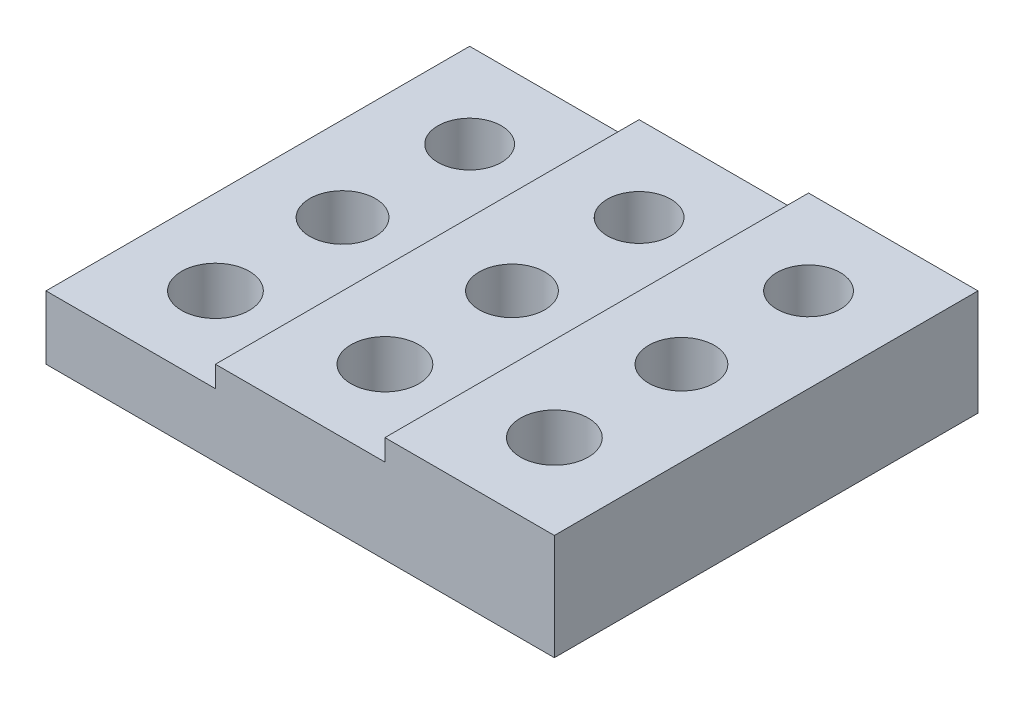
ISO-10303-21;
HEADER;
FILE_DESCRIPTION(('STEP AP214'),'2;1');
FILE_NAME('part.step','',(''),(''),'','','');
FILE_SCHEMA(('AUTOMOTIVE_DESIGN { 1 0 10303 214 1 1 1 1 }'));
ENDSEC;
DATA;
#1=APPLICATION_CONTEXT('core data for automotive mechanical design processes');
#2=APPLICATION_PROTOCOL_DEFINITION('international standard','automotive_design',2000,#1);
#3=PRODUCT_CONTEXT('',#1,'mechanical');
#4=PRODUCT('Part','Part','',(#3));
#5=PRODUCT_RELATED_PRODUCT_CATEGORY('part','',(#4));
#6=PRODUCT_DEFINITION_FORMATION('','',#4);
#7=PRODUCT_DEFINITION_CONTEXT('part definition',#1,'design');
#8=PRODUCT_DEFINITION('design','',#6,#7);
#9=PRODUCT_DEFINITION_SHAPE('','',#8);
#10=(LENGTH_UNIT() NAMED_UNIT(*) SI_UNIT(.MILLI.,.METRE.));
#11=(NAMED_UNIT(*) PLANE_ANGLE_UNIT() SI_UNIT($,.RADIAN.));
#12=(NAMED_UNIT(*) SI_UNIT($,.STERADIAN.) SOLID_ANGLE_UNIT());
#13=UNCERTAINTY_MEASURE_WITH_UNIT(LENGTH_MEASURE(1.E-05),#10,'distance_accuracy_value','');
#14=(GEOMETRIC_REPRESENTATION_CONTEXT(3) GLOBAL_UNCERTAINTY_ASSIGNED_CONTEXT((#13)) GLOBAL_UNIT_ASSIGNED_CONTEXT((#10,
#11,#12)) REPRESENTATION_CONTEXT('',''));
#15=CARTESIAN_POINT('',(0.,0.,0.));
#16=DIRECTION('',(0.,0.,1.));
#17=DIRECTION('',(1.,0.,0.));
#18=AXIS2_PLACEMENT_3D('',#15,#16,#17);
#19=CARTESIAN_POINT('',(8.,5.,0.));
#20=DIRECTION('',(-1.,0.,0.));
#21=DIRECTION('',(0.,0.,1.));
#22=AXIS2_PLACEMENT_3D('',#19,#20,#21);
#23=PLANE('',#22);
#24=DIRECTION('',(0.,0.,-1.));
#25=VECTOR('',#24,1.);
#26=CARTESIAN_POINT('',(8.,4.,0.));
#27=LINE('',#26,#25);
#28=CARTESIAN_POINT('',(8.,4.,0.));
#29=VERTEX_POINT('',#28);
#30=CARTESIAN_POINT('',(8.,4.,-20.));
#31=VERTEX_POINT('',#30);
#32=EDGE_CURVE('E63',#29,#31,#27,.T.);
#33=ORIENTED_EDGE('',*,*,#32,.F.);
#34=DIRECTION('',(0.,-1.,0.));
#35=VECTOR('',#34,1.);
#36=CARTESIAN_POINT('',(8.,5.,0.));
#37=LINE('',#36,#35);
#38=CARTESIAN_POINT('',(8.,5.,0.));
#39=VERTEX_POINT('',#38);
#40=EDGE_CURVE('E11',#39,#29,#37,.T.);
#41=ORIENTED_EDGE('',*,*,#40,.F.);
#42=DIRECTION('',(0.,0.,-1.));
#43=VECTOR('',#42,1.);
#44=CARTESIAN_POINT('',(8.,5.,0.));
#45=LINE('',#44,#43);
#46=CARTESIAN_POINT('',(8.,5.,-20.));
#47=VERTEX_POINT('',#46);
#48=EDGE_CURVE('E211',#39,#47,#45,.T.);
#49=ORIENTED_EDGE('',*,*,#48,.T.);
#50=DIRECTION('',(0.,-1.,0.));
#51=VECTOR('',#50,1.);
#52=CARTESIAN_POINT('',(8.,5.,-20.));
#53=LINE('',#52,#51);
#54=EDGE_CURVE('E226',#47,#31,#53,.T.);
#55=ORIENTED_EDGE('',*,*,#54,.T.);
#56=EDGE_LOOP('',(#33,#41,#49,#55));
#57=FACE_BOUND('',#56,.T.);
#58=ADVANCED_FACE('F39',(#57),#23,.T.);
#59=CARTESIAN_POINT('',(0.,5.,0.));
#60=DIRECTION('',(0.,0.,-1.));
#61=DIRECTION('',(-1.,0.,0.));
#62=AXIS2_PLACEMENT_3D('',#59,#60,#61);
#63=PLANE('',#62);
#64=DIRECTION('',(1.,0.,0.));
#65=VECTOR('',#64,1.);
#66=CARTESIAN_POINT('',(0.,0.,0.));
#67=LINE('',#66,#65);
#68=CARTESIAN_POINT('',(-8.,0.,0.));
#69=VERTEX_POINT('',#68);
#70=CARTESIAN_POINT('',(16.,0.,0.));
#71=VERTEX_POINT('',#70);
#72=EDGE_CURVE('E238',#69,#71,#67,.T.);
#73=ORIENTED_EDGE('',*,*,#72,.T.);
#74=DIRECTION('',(0.,-1.,0.));
#75=VECTOR('',#74,1.);
#76=CARTESIAN_POINT('',(16.,5.,0.));
#77=LINE('',#76,#75);
#78=CARTESIAN_POINT('',(16.,5.,0.));
#79=VERTEX_POINT('',#78);
#80=EDGE_CURVE('E48',#79,#71,#77,.T.);
#81=ORIENTED_EDGE('',*,*,#80,.F.);
#82=DIRECTION('',(1.,0.,0.));
#83=VECTOR('',#82,1.);
#84=CARTESIAN_POINT('',(0.,5.,0.));
#85=LINE('',#84,#83);
#86=EDGE_CURVE('E215',#39,#79,#85,.T.);
#87=ORIENTED_EDGE('',*,*,#86,.F.);
#88=ORIENTED_EDGE('',*,*,#40,.T.);
#89=DIRECTION('',(-1.,0.,0.));
#90=VECTOR('',#89,1.);
#91=CARTESIAN_POINT('',(0.,4.,0.));
#92=LINE('',#91,#90);
#93=CARTESIAN_POINT('',(0.,4.,0.));
#94=VERTEX_POINT('',#93);
#95=EDGE_CURVE('E171',#29,#94,#92,.T.);
#96=ORIENTED_EDGE('',*,*,#95,.T.);
#97=DIRECTION('',(0.,-1.,0.));
#98=VECTOR('',#97,1.);
#99=CARTESIAN_POINT('',(0.,4.,0.));
#100=LINE('',#99,#98);
#101=CARTESIAN_POINT('',(0.,3.,0.));
#102=VERTEX_POINT('',#101);
#103=EDGE_CURVE('E131',#94,#102,#100,.T.);
#104=ORIENTED_EDGE('',*,*,#103,.T.);
#105=DIRECTION('',(-1.,0.,0.));
#106=VECTOR('',#105,1.);
#107=CARTESIAN_POINT('',(0.,3.,0.));
#108=LINE('',#107,#106);
#109=CARTESIAN_POINT('',(-8.,3.,0.));
#110=VERTEX_POINT('',#109);
#111=EDGE_CURVE('E122',#102,#110,#108,.T.);
#112=ORIENTED_EDGE('',*,*,#111,.T.);
#113=DIRECTION('',(0.,-1.,0.));
#114=VECTOR('',#113,1.);
#115=CARTESIAN_POINT('',(-8.,3.,0.));
#116=LINE('',#115,#114);
#117=EDGE_CURVE('E105',#110,#69,#116,.T.);
#118=ORIENTED_EDGE('',*,*,#117,.T.);
#119=EDGE_LOOP('',(#73,#81,#87,#88,#96,#104,#112,#118));
#120=FACE_BOUND('',#119,.T.);
#121=ADVANCED_FACE('F129',(#120),#63,.F.);
#122=CARTESIAN_POINT('',(16.,5.,0.));
#123=DIRECTION('',(-1.,0.,0.));
#124=DIRECTION('',(0.,0.,1.));
#125=AXIS2_PLACEMENT_3D('',#122,#123,#124);
#126=PLANE('',#125);
#127=DIRECTION('',(0.,0.,-1.));
#128=VECTOR('',#127,1.);
#129=CARTESIAN_POINT('',(16.,0.,0.));
#130=LINE('',#129,#128);
#131=CARTESIAN_POINT('',(16.,0.,-20.));
#132=VERTEX_POINT('',#131);
#133=EDGE_CURVE('E241',#71,#132,#130,.T.);
#134=ORIENTED_EDGE('',*,*,#133,.T.);
#135=DIRECTION('',(0.,-1.,0.));
#136=VECTOR('',#135,1.);
#137=CARTESIAN_POINT('',(16.,5.,-20.));
#138=LINE('',#137,#136);
#139=CARTESIAN_POINT('',(16.,5.,-20.));
#140=VERTEX_POINT('',#139);
#141=EDGE_CURVE('E250',#140,#132,#138,.T.);
#142=ORIENTED_EDGE('',*,*,#141,.F.);
#143=DIRECTION('',(0.,0.,-1.));
#144=VECTOR('',#143,1.);
#145=CARTESIAN_POINT('',(16.,5.,0.));
#146=LINE('',#145,#144);
#147=EDGE_CURVE('E219',#79,#140,#146,.T.);
#148=ORIENTED_EDGE('',*,*,#147,.F.);
#149=ORIENTED_EDGE('',*,*,#80,.T.);
#150=EDGE_LOOP('',(#134,#142,#148,#149));
#151=FACE_BOUND('',#150,.T.);
#152=ADVANCED_FACE('F256',(#151),#126,.F.);
#153=CARTESIAN_POINT('',(12.,5.,-4.));
#154=DIRECTION('',(0.,-1.,0.));
#155=DIRECTION('',(0.,0.,-1.));
#156=AXIS2_PLACEMENT_3D('',#153,#154,#155);
#157=CYLINDRICAL_SURFACE('',#156,1.6);
#158=CARTESIAN_POINT('',(12.,5.,-4.));
#159=DIRECTION('',(0.,1.,0.));
#160=DIRECTION('',(0.,0.,1.));
#161=AXIS2_PLACEMENT_3D('',#158,#159,#160);
#162=CIRCLE('',#161,1.6);
#163=CARTESIAN_POINT('',(12.,5.,-2.4));
#164=VERTEX_POINT('',#163);
#165=EDGE_CURVE('E207',#164,#164,#162,.T.);
#166=ORIENTED_EDGE('',*,*,#165,.T.);
#167=EDGE_LOOP('',(#166));
#168=FACE_BOUND('',#167,.T.);
#169=CARTESIAN_POINT('',(12.,0.,-4.));
#170=DIRECTION('',(0.,1.,0.));
#171=DIRECTION('',(0.,0.,1.));
#172=AXIS2_PLACEMENT_3D('',#169,#170,#171);
#173=CIRCLE('',#172,1.6);
#174=CARTESIAN_POINT('',(12.,0.,-2.4));
#175=VERTEX_POINT('',#174);
#176=EDGE_CURVE('E234',#175,#175,#173,.T.);
#177=ORIENTED_EDGE('',*,*,#176,.F.);
#178=EDGE_LOOP('',(#177));
#179=FACE_BOUND('',#178,.T.);
#180=ADVANCED_FACE('F297',(#168,#179),#157,.F.);
#181=CARTESIAN_POINT('',(12.,5.,-16.));
#182=DIRECTION('',(0.,-1.,0.));
#183=DIRECTION('',(0.,0.,-1.));
#184=AXIS2_PLACEMENT_3D('',#181,#182,#183);
#185=CYLINDRICAL_SURFACE('',#184,1.5);
#186=CARTESIAN_POINT('',(12.,5.,-16.));
#187=DIRECTION('',(0.,1.,0.));
#188=DIRECTION('',(0.,0.,1.));
#189=AXIS2_PLACEMENT_3D('',#186,#187,#188);
#190=CIRCLE('',#189,1.5);
#191=CARTESIAN_POINT('',(12.,5.,-14.5));
#192=VERTEX_POINT('',#191);
#193=EDGE_CURVE('E202',#192,#192,#190,.T.);
#194=ORIENTED_EDGE('',*,*,#193,.T.);
#195=EDGE_LOOP('',(#194));
#196=FACE_BOUND('',#195,.T.);
#197=CARTESIAN_POINT('',(12.,0.,-16.));
#198=DIRECTION('',(0.,1.,0.));
#199=DIRECTION('',(0.,0.,1.));
#200=AXIS2_PLACEMENT_3D('',#197,#198,#199);
#201=CIRCLE('',#200,1.5);
#202=CARTESIAN_POINT('',(12.,0.,-14.5));
#203=VERTEX_POINT('',#202);
#204=EDGE_CURVE('E230',#203,#203,#201,.T.);
#205=ORIENTED_EDGE('',*,*,#204,.F.);
#206=EDGE_LOOP('',(#205));
#207=FACE_BOUND('',#206,.T.);
#208=ADVANCED_FACE('F299',(#196,#207),#185,.F.);
#209=CARTESIAN_POINT('',(12.,5.,-10.));
#210=DIRECTION('',(0.,-1.,0.));
#211=DIRECTION('',(0.,0.,-1.));
#212=AXIS2_PLACEMENT_3D('',#209,#210,#211);
#213=CYLINDRICAL_SURFACE('',#212,1.55);
#214=CARTESIAN_POINT('',(12.,5.,-10.));
#215=DIRECTION('',(0.,1.,0.));
#216=DIRECTION('',(0.,0.,1.));
#217=AXIS2_PLACEMENT_3D('',#214,#215,#216);
#218=CIRCLE('',#217,1.55);
#219=CARTESIAN_POINT('',(12.,5.,-8.45));
#220=VERTEX_POINT('',#219);
#221=EDGE_CURVE('E198',#220,#220,#218,.T.);
#222=ORIENTED_EDGE('',*,*,#221,.T.);
#223=EDGE_LOOP('',(#222));
#224=FACE_BOUND('',#223,.T.);
#225=CARTESIAN_POINT('',(12.,0.,-10.));
#226=DIRECTION('',(0.,1.,0.));
#227=DIRECTION('',(0.,0.,1.));
#228=AXIS2_PLACEMENT_3D('',#225,#226,#227);
#229=CIRCLE('',#228,1.55);
#230=CARTESIAN_POINT('',(12.,0.,-8.45));
#231=VERTEX_POINT('',#230);
#232=EDGE_CURVE('E197',#231,#231,#229,.T.);
#233=ORIENTED_EDGE('',*,*,#232,.F.);
#234=EDGE_LOOP('',(#233));
#235=FACE_BOUND('',#234,.T.);
#236=ADVANCED_FACE('F41',(#224,#235),#213,.F.);
#237=CARTESIAN_POINT('',(0.,5.,-20.));
#238=DIRECTION('',(0.,0.,-1.));
#239=DIRECTION('',(-1.,0.,0.));
#240=AXIS2_PLACEMENT_3D('',#237,#238,#239);
#241=PLANE('',#240);
#242=DIRECTION('',(1.,0.,0.));
#243=VECTOR('',#242,1.);
#244=CARTESIAN_POINT('',(0.,0.,-20.));
#245=LINE('',#244,#243);
#246=CARTESIAN_POINT('',(-8.,0.,-20.));
#247=VERTEX_POINT('',#246);
#248=EDGE_CURVE('E203',#247,#132,#245,.T.);
#249=ORIENTED_EDGE('',*,*,#248,.F.);
#250=DIRECTION('',(0.,-1.,0.));
#251=VECTOR('',#250,1.);
#252=CARTESIAN_POINT('',(-8.,3.,-20.));
#253=LINE('',#252,#251);
#254=CARTESIAN_POINT('',(-8.,3.,-20.));
#255=VERTEX_POINT('',#254);
#256=EDGE_CURVE('E117',#255,#247,#253,.T.);
#257=ORIENTED_EDGE('',*,*,#256,.F.);
#258=DIRECTION('',(-1.,0.,0.));
#259=VECTOR('',#258,1.);
#260=CARTESIAN_POINT('',(0.,3.,-20.));
#261=LINE('',#260,#259);
#262=CARTESIAN_POINT('',(0.,3.,-20.));
#263=VERTEX_POINT('',#262);
#264=EDGE_CURVE('E124',#263,#255,#261,.T.);
#265=ORIENTED_EDGE('',*,*,#264,.F.);
#266=DIRECTION('',(0.,-1.,0.));
#267=VECTOR('',#266,1.);
#268=CARTESIAN_POINT('',(0.,4.,-20.));
#269=LINE('',#268,#267);
#270=CARTESIAN_POINT('',(0.,4.,-20.));
#271=VERTEX_POINT('',#270);
#272=EDGE_CURVE('E194',#271,#263,#269,.T.);
#273=ORIENTED_EDGE('',*,*,#272,.F.);
#274=DIRECTION('',(-1.,0.,0.));
#275=VECTOR('',#274,1.);
#276=CARTESIAN_POINT('',(0.,4.,-20.));
#277=LINE('',#276,#275);
#278=EDGE_CURVE('E164',#31,#271,#277,.T.);
#279=ORIENTED_EDGE('',*,*,#278,.F.);
#280=ORIENTED_EDGE('',*,*,#54,.F.);
#281=DIRECTION('',(1.,0.,0.));
#282=VECTOR('',#281,1.);
#283=CARTESIAN_POINT('',(0.,5.,-20.));
#284=LINE('',#283,#282);
#285=EDGE_CURVE('E222',#47,#140,#284,.T.);
#286=ORIENTED_EDGE('',*,*,#285,.T.);
#287=ORIENTED_EDGE('',*,*,#141,.T.);
#288=EDGE_LOOP('',(#249,#257,#265,#273,#279,#280,#286,#287));
#289=FACE_BOUND('',#288,.T.);
#290=ADVANCED_FACE('F263',(#289),#241,.T.);
#291=CARTESIAN_POINT('',(0.,5.,0.));
#292=DIRECTION('',(0.,1.,0.));
#293=DIRECTION('',(0.,0.,1.));
#294=AXIS2_PLACEMENT_3D('',#291,#292,#293);
#295=PLANE('',#294);
#296=ORIENTED_EDGE('',*,*,#221,.F.);
#297=EDGE_LOOP('',(#296));
#298=FACE_BOUND('',#297,.T.);
#299=ORIENTED_EDGE('',*,*,#193,.F.);
#300=EDGE_LOOP('',(#299));
#301=FACE_BOUND('',#300,.T.);
#302=ORIENTED_EDGE('',*,*,#165,.F.);
#303=EDGE_LOOP('',(#302));
#304=FACE_BOUND('',#303,.T.);
#305=ORIENTED_EDGE('',*,*,#48,.F.);
#306=ORIENTED_EDGE('',*,*,#86,.T.);
#307=ORIENTED_EDGE('',*,*,#147,.T.);
#308=ORIENTED_EDGE('',*,*,#285,.F.);
#309=EDGE_LOOP('',(#305,#306,#307,#308));
#310=FACE_BOUND('',#309,.T.);
#311=ADVANCED_FACE('F268',(#298,#301,#304,#310),#295,.T.);
#312=CARTESIAN_POINT('',(0.,0.,0.));
#313=DIRECTION('',(0.,1.,0.));
#314=DIRECTION('',(0.,0.,1.));
#315=AXIS2_PLACEMENT_3D('',#312,#313,#314);
#316=PLANE('',#315);
#317=ORIENTED_EDGE('',*,*,#232,.T.);
#318=EDGE_LOOP('',(#317));
#319=FACE_BOUND('',#318,.T.);
#320=ORIENTED_EDGE('',*,*,#204,.T.);
#321=EDGE_LOOP('',(#320));
#322=FACE_BOUND('',#321,.T.);
#323=ORIENTED_EDGE('',*,*,#176,.T.);
#324=EDGE_LOOP('',(#323));
#325=FACE_BOUND('',#324,.T.);
#326=ORIENTED_EDGE('',*,*,#72,.F.);
#327=DIRECTION('',(0.,0.,-1.));
#328=VECTOR('',#327,1.);
#329=CARTESIAN_POINT('',(-8.,0.,0.));
#330=LINE('',#329,#328);
#331=EDGE_CURVE('E111',#69,#247,#330,.T.);
#332=ORIENTED_EDGE('',*,*,#331,.T.);
#333=ORIENTED_EDGE('',*,*,#248,.T.);
#334=ORIENTED_EDGE('',*,*,#133,.F.);
#335=EDGE_LOOP('',(#326,#332,#333,#334));
#336=FACE_BOUND('',#335,.T.);
#337=CARTESIAN_POINT('',(4.,0.,-16.));
#338=DIRECTION('',(0.,1.,0.));
#339=DIRECTION('',(0.,0.,1.));
#340=AXIS2_PLACEMENT_3D('',#337,#338,#339);
#341=CIRCLE('',#340,1.5);
#342=CARTESIAN_POINT('',(4.,0.,-14.5));
#343=VERTEX_POINT('',#342);
#344=EDGE_CURVE('E116',#343,#343,#341,.F.);
#345=ORIENTED_EDGE('',*,*,#344,.F.);
#346=EDGE_LOOP('',(#345));
#347=FACE_BOUND('',#346,.T.);
#348=CARTESIAN_POINT('',(4.,0.,-4.));
#349=DIRECTION('',(0.,1.,0.));
#350=DIRECTION('',(0.,0.,1.));
#351=AXIS2_PLACEMENT_3D('',#348,#349,#350);
#352=CIRCLE('',#351,1.6);
#353=CARTESIAN_POINT('',(4.,0.,-2.4));
#354=VERTEX_POINT('',#353);
#355=EDGE_CURVE('E185',#354,#354,#352,.F.);
#356=ORIENTED_EDGE('',*,*,#355,.F.);
#357=EDGE_LOOP('',(#356));
#358=FACE_BOUND('',#357,.T.);
#359=CARTESIAN_POINT('',(4.,0.,-10.));
#360=DIRECTION('',(0.,1.,0.));
#361=DIRECTION('',(0.,0.,1.));
#362=AXIS2_PLACEMENT_3D('',#359,#360,#361);
#363=CIRCLE('',#362,1.55);
#364=CARTESIAN_POINT('',(4.,0.,-8.45));
#365=VERTEX_POINT('',#364);
#366=EDGE_CURVE('E161',#365,#365,#363,.F.);
#367=ORIENTED_EDGE('',*,*,#366,.F.);
#368=EDGE_LOOP('',(#367));
#369=FACE_BOUND('',#368,.T.);
#370=CARTESIAN_POINT('',(-4.,0.,-10.));
#371=DIRECTION('',(0.,1.,0.));
#372=DIRECTION('',(0.,0.,1.));
#373=AXIS2_PLACEMENT_3D('',#370,#371,#372);
#374=CIRCLE('',#373,1.55);
#375=CARTESIAN_POINT('',(-4.,0.,-8.45));
#376=VERTEX_POINT('',#375);
#377=EDGE_CURVE('E140',#376,#376,#374,.T.);
#378=ORIENTED_EDGE('',*,*,#377,.T.);
#379=EDGE_LOOP('',(#378));
#380=FACE_BOUND('',#379,.T.);
#381=CARTESIAN_POINT('',(-4.,0.,-16.));
#382=DIRECTION('',(0.,1.,0.));
#383=DIRECTION('',(0.,0.,1.));
#384=AXIS2_PLACEMENT_3D('',#381,#382,#383);
#385=CIRCLE('',#384,1.5);
#386=CARTESIAN_POINT('',(-4.,0.,-14.5));
#387=VERTEX_POINT('',#386);
#388=EDGE_CURVE('E144',#387,#387,#385,.T.);
#389=ORIENTED_EDGE('',*,*,#388,.T.);
#390=EDGE_LOOP('',(#389));
#391=FACE_BOUND('',#390,.T.);
#392=CARTESIAN_POINT('',(-4.,0.,-4.));
#393=DIRECTION('',(0.,1.,0.));
#394=DIRECTION('',(0.,0.,1.));
#395=AXIS2_PLACEMENT_3D('',#392,#393,#394);
#396=CIRCLE('',#395,1.6);
#397=CARTESIAN_POINT('',(-4.,0.,-2.4));
#398=VERTEX_POINT('',#397);
#399=EDGE_CURVE('E148',#398,#398,#396,.T.);
#400=ORIENTED_EDGE('',*,*,#399,.T.);
#401=EDGE_LOOP('',(#400));
#402=FACE_BOUND('',#401,.T.);
#403=ADVANCED_FACE('F260',(#319,#322,#325,#336,#347,#358,#369,#380,#391,#402),#316,.F.);
#404=CARTESIAN_POINT('',(0.,4.,0.));
#405=DIRECTION('',(-1.,0.,0.));
#406=DIRECTION('',(0.,0.,1.));
#407=AXIS2_PLACEMENT_3D('',#404,#405,#406);
#408=PLANE('',#407);
#409=DIRECTION('',(0.,0.,-1.));
#410=VECTOR('',#409,1.);
#411=CARTESIAN_POINT('',(0.,3.,0.));
#412=LINE('',#411,#410);
#413=EDGE_CURVE('E55',#102,#263,#412,.T.);
#414=ORIENTED_EDGE('',*,*,#413,.F.);
#415=ORIENTED_EDGE('',*,*,#103,.F.);
#416=DIRECTION('',(0.,0.,-1.));
#417=VECTOR('',#416,1.);
#418=CARTESIAN_POINT('',(0.,4.,0.));
#419=LINE('',#418,#417);
#420=EDGE_CURVE('E167',#94,#271,#419,.T.);
#421=ORIENTED_EDGE('',*,*,#420,.T.);
#422=ORIENTED_EDGE('',*,*,#272,.T.);
#423=EDGE_LOOP('',(#414,#415,#421,#422));
#424=FACE_BOUND('',#423,.T.);
#425=ADVANCED_FACE('F275',(#424),#408,.T.);
#426=CARTESIAN_POINT('',(4.,4.,-4.));
#427=DIRECTION('',(0.,-1.,0.));
#428=DIRECTION('',(0.,0.,-1.));
#429=AXIS2_PLACEMENT_3D('',#426,#427,#428);
#430=CYLINDRICAL_SURFACE('',#429,1.6);
#431=CARTESIAN_POINT('',(4.,4.,-4.));
#432=DIRECTION('',(0.,1.,0.));
#433=DIRECTION('',(0.,0.,1.));
#434=AXIS2_PLACEMENT_3D('',#431,#432,#433);
#435=CIRCLE('',#434,1.6);
#436=CARTESIAN_POINT('',(4.,4.,-2.4));
#437=VERTEX_POINT('',#436);
#438=EDGE_CURVE('E174',#437,#437,#435,.F.);
#439=ORIENTED_EDGE('',*,*,#438,.F.);
#440=EDGE_LOOP('',(#439));
#441=FACE_BOUND('',#440,.T.);
#442=ORIENTED_EDGE('',*,*,#355,.T.);
#443=EDGE_LOOP('',(#442));
#444=FACE_BOUND('',#443,.T.);
#445=ADVANCED_FACE('F277',(#441,#444),#430,.F.);
#446=CARTESIAN_POINT('',(4.,4.,-16.));
#447=DIRECTION('',(0.,-1.,0.));
#448=DIRECTION('',(0.,0.,-1.));
#449=AXIS2_PLACEMENT_3D('',#446,#447,#448);
#450=CYLINDRICAL_SURFACE('',#449,1.5);
#451=CARTESIAN_POINT('',(4.,4.,-16.));
#452=DIRECTION('',(0.,1.,0.));
#453=DIRECTION('',(0.,0.,1.));
#454=AXIS2_PLACEMENT_3D('',#451,#452,#453);
#455=CIRCLE('',#454,1.5);
#456=CARTESIAN_POINT('',(4.,4.,-14.5));
#457=VERTEX_POINT('',#456);
#458=EDGE_CURVE('E157',#457,#457,#455,.F.);
#459=ORIENTED_EDGE('',*,*,#458,.F.);
#460=EDGE_LOOP('',(#459));
#461=FACE_BOUND('',#460,.T.);
#462=ORIENTED_EDGE('',*,*,#344,.T.);
#463=EDGE_LOOP('',(#462));
#464=FACE_BOUND('',#463,.T.);
#465=ADVANCED_FACE('F283',(#461,#464),#450,.F.);
#466=CARTESIAN_POINT('',(4.,4.,-10.));
#467=DIRECTION('',(0.,-1.,0.));
#468=DIRECTION('',(0.,0.,-1.));
#469=AXIS2_PLACEMENT_3D('',#466,#467,#468);
#470=CYLINDRICAL_SURFACE('',#469,1.55);
#471=CARTESIAN_POINT('',(4.,4.,-10.));
#472=DIRECTION('',(0.,1.,0.));
#473=DIRECTION('',(0.,0.,1.));
#474=AXIS2_PLACEMENT_3D('',#471,#472,#473);
#475=CIRCLE('',#474,1.55);
#476=CARTESIAN_POINT('',(4.,4.,-8.45));
#477=VERTEX_POINT('',#476);
#478=EDGE_CURVE('E178',#477,#477,#475,.F.);
#479=ORIENTED_EDGE('',*,*,#478,.F.);
#480=EDGE_LOOP('',(#479));
#481=FACE_BOUND('',#480,.T.);
#482=ORIENTED_EDGE('',*,*,#366,.T.);
#483=EDGE_LOOP('',(#482));
#484=FACE_BOUND('',#483,.T.);
#485=ADVANCED_FACE('F371',(#481,#484),#470,.F.);
#486=CARTESIAN_POINT('',(0.,4.,0.));
#487=DIRECTION('',(0.,1.,0.));
#488=DIRECTION('',(0.,0.,1.));
#489=AXIS2_PLACEMENT_3D('',#486,#487,#488);
#490=PLANE('',#489);
#491=ORIENTED_EDGE('',*,*,#458,.T.);
#492=EDGE_LOOP('',(#491));
#493=FACE_BOUND('',#492,.T.);
#494=ORIENTED_EDGE('',*,*,#32,.T.);
#495=ORIENTED_EDGE('',*,*,#278,.T.);
#496=ORIENTED_EDGE('',*,*,#420,.F.);
#497=ORIENTED_EDGE('',*,*,#95,.F.);
#498=EDGE_LOOP('',(#494,#495,#496,#497));
#499=FACE_BOUND('',#498,.T.);
#500=ORIENTED_EDGE('',*,*,#438,.T.);
#501=EDGE_LOOP('',(#500));
#502=FACE_BOUND('',#501,.T.);
#503=ORIENTED_EDGE('',*,*,#478,.T.);
#504=EDGE_LOOP('',(#503));
#505=FACE_BOUND('',#504,.T.);
#506=ADVANCED_FACE('F272',(#493,#499,#502,#505),#490,.T.);
#507=CARTESIAN_POINT('',(-8.,3.,0.));
#508=DIRECTION('',(-1.,0.,0.));
#509=DIRECTION('',(0.,0.,1.));
#510=AXIS2_PLACEMENT_3D('',#507,#508,#509);
#511=PLANE('',#510);
#512=ORIENTED_EDGE('',*,*,#331,.F.);
#513=ORIENTED_EDGE('',*,*,#117,.F.);
#514=DIRECTION('',(0.,0.,-1.));
#515=VECTOR('',#514,1.);
#516=CARTESIAN_POINT('',(-8.,3.,0.));
#517=LINE('',#516,#515);
#518=EDGE_CURVE('E109',#110,#255,#517,.T.);
#519=ORIENTED_EDGE('',*,*,#518,.T.);
#520=ORIENTED_EDGE('',*,*,#256,.T.);
#521=EDGE_LOOP('',(#512,#513,#519,#520));
#522=FACE_BOUND('',#521,.T.);
#523=ADVANCED_FACE('F107',(#522),#511,.T.);
#524=CARTESIAN_POINT('',(-4.,3.,-4.));
#525=DIRECTION('',(0.,-1.,0.));
#526=DIRECTION('',(0.,0.,-1.));
#527=AXIS2_PLACEMENT_3D('',#524,#525,#526);
#528=CYLINDRICAL_SURFACE('',#527,1.6);
#529=CARTESIAN_POINT('',(-4.,3.,-4.));
#530=DIRECTION('',(0.,1.,0.));
#531=DIRECTION('',(0.,0.,1.));
#532=AXIS2_PLACEMENT_3D('',#529,#530,#531);
#533=CIRCLE('',#532,1.6);
#534=CARTESIAN_POINT('',(-4.,3.,-2.4));
#535=VERTEX_POINT('',#534);
#536=EDGE_CURVE('E127',#535,#535,#533,.T.);
#537=ORIENTED_EDGE('',*,*,#536,.T.);
#538=EDGE_LOOP('',(#537));
#539=FACE_BOUND('',#538,.T.);
#540=ORIENTED_EDGE('',*,*,#399,.F.);
#541=EDGE_LOOP('',(#540));
#542=FACE_BOUND('',#541,.T.);
#543=ADVANCED_FACE('F420',(#539,#542),#528,.F.);
#544=CARTESIAN_POINT('',(-4.,3.,-16.));
#545=DIRECTION('',(0.,-1.,0.));
#546=DIRECTION('',(0.,0.,-1.));
#547=AXIS2_PLACEMENT_3D('',#544,#545,#546);
#548=CYLINDRICAL_SURFACE('',#547,1.5);
#549=CARTESIAN_POINT('',(-4.,3.,-16.));
#550=DIRECTION('',(0.,1.,0.));
#551=DIRECTION('',(0.,0.,1.));
#552=AXIS2_PLACEMENT_3D('',#549,#550,#551);
#553=CIRCLE('',#552,1.5);
#554=CARTESIAN_POINT('',(-4.,3.,-14.5));
#555=VERTEX_POINT('',#554);
#556=EDGE_CURVE('E468',#555,#555,#553,.T.);
#557=ORIENTED_EDGE('',*,*,#556,.T.);
#558=EDGE_LOOP('',(#557));
#559=FACE_BOUND('',#558,.T.);
#560=ORIENTED_EDGE('',*,*,#388,.F.);
#561=EDGE_LOOP('',(#560));
#562=FACE_BOUND('',#561,.T.);
#563=ADVANCED_FACE('F429',(#559,#562),#548,.F.);
#564=CARTESIAN_POINT('',(-4.,3.,-10.));
#565=DIRECTION('',(0.,-1.,0.));
#566=DIRECTION('',(0.,0.,-1.));
#567=AXIS2_PLACEMENT_3D('',#564,#565,#566);
#568=CYLINDRICAL_SURFACE('',#567,1.55);
#569=CARTESIAN_POINT('',(-4.,3.,-10.));
#570=DIRECTION('',(0.,1.,0.));
#571=DIRECTION('',(0.,0.,1.));
#572=AXIS2_PLACEMENT_3D('',#569,#570,#571);
#573=CIRCLE('',#572,1.55);
#574=CARTESIAN_POINT('',(-4.,3.,-8.45));
#575=VERTEX_POINT('',#574);
#576=EDGE_CURVE('E154',#575,#575,#573,.T.);
#577=ORIENTED_EDGE('',*,*,#576,.T.);
#578=EDGE_LOOP('',(#577));
#579=FACE_BOUND('',#578,.T.);
#580=ORIENTED_EDGE('',*,*,#377,.F.);
#581=EDGE_LOOP('',(#580));
#582=FACE_BOUND('',#581,.T.);
#583=ADVANCED_FACE('F439',(#579,#582),#568,.F.);
#584=CARTESIAN_POINT('',(0.,3.,0.));
#585=DIRECTION('',(0.,1.,0.));
#586=DIRECTION('',(0.,0.,1.));
#587=AXIS2_PLACEMENT_3D('',#584,#585,#586);
#588=PLANE('',#587);
#589=ORIENTED_EDGE('',*,*,#576,.F.);
#590=EDGE_LOOP('',(#589));
#591=FACE_BOUND('',#590,.T.);
#592=ORIENTED_EDGE('',*,*,#556,.F.);
#593=EDGE_LOOP('',(#592));
#594=FACE_BOUND('',#593,.T.);
#595=ORIENTED_EDGE('',*,*,#536,.F.);
#596=EDGE_LOOP('',(#595));
#597=FACE_BOUND('',#596,.T.);
#598=ORIENTED_EDGE('',*,*,#518,.F.);
#599=ORIENTED_EDGE('',*,*,#111,.F.);
#600=ORIENTED_EDGE('',*,*,#413,.T.);
#601=ORIENTED_EDGE('',*,*,#264,.T.);
#602=EDGE_LOOP('',(#598,#599,#600,#601));
#603=FACE_BOUND('',#602,.T.);
#604=ADVANCED_FACE('F121',(#591,#594,#597,#603),#588,.T.);
#605=CLOSED_SHELL('',(#58,#121,#152,#180,#208,#236,#290,#311,#403,#425,#445,#465,#485,#506,#523,
#543,#563,#583,#604));
#606=MANIFOLD_SOLID_BREP('B2',#605);
#607=ADVANCED_BREP_SHAPE_REPRESENTATION('',(#18,#606),#14);
#608=SHAPE_DEFINITION_REPRESENTATION(#9,#607);
ENDSEC;
END-ISO-10303-21;
